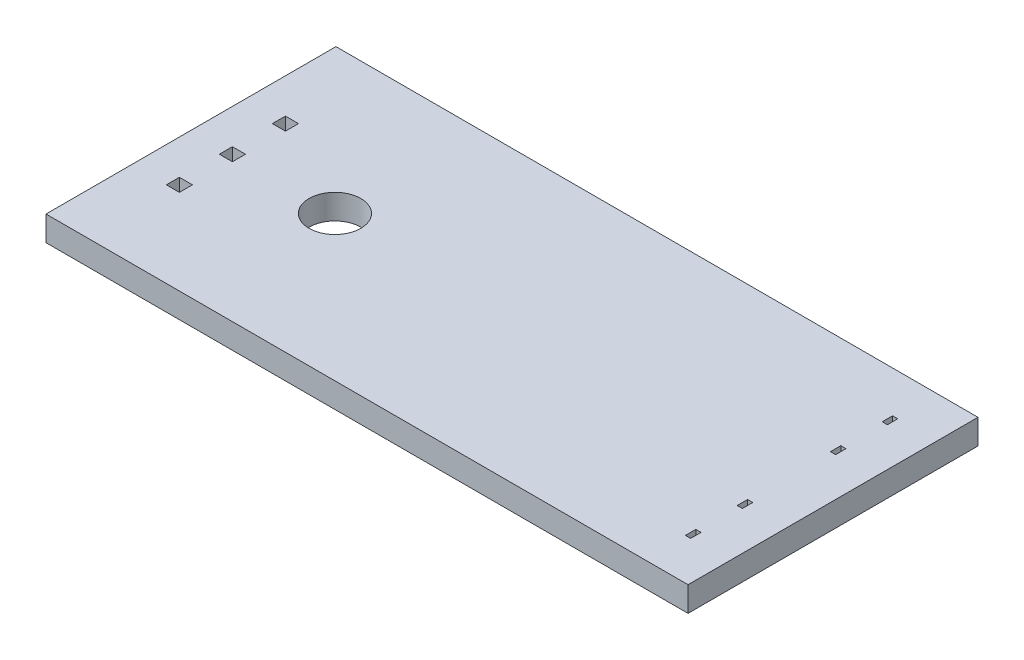
ISO-10303-21;
HEADER;
FILE_DESCRIPTION(('STEP AP214'),'2;1');
FILE_NAME('part.step','',(''),(''),'','','');
FILE_SCHEMA(('AUTOMOTIVE_DESIGN { 1 0 10303 214 1 1 1 1 }'));
ENDSEC;
DATA;
#1=APPLICATION_CONTEXT('core data for automotive mechanical design processes');
#2=APPLICATION_PROTOCOL_DEFINITION('international standard','automotive_design',2000,#1);
#3=PRODUCT_CONTEXT('',#1,'mechanical');
#4=PRODUCT('Part','Part','',(#3));
#5=PRODUCT_RELATED_PRODUCT_CATEGORY('part','',(#4));
#6=PRODUCT_DEFINITION_FORMATION('','',#4);
#7=PRODUCT_DEFINITION_CONTEXT('part definition',#1,'design');
#8=PRODUCT_DEFINITION('design','',#6,#7);
#9=PRODUCT_DEFINITION_SHAPE('','',#8);
#10=(LENGTH_UNIT() NAMED_UNIT(*) SI_UNIT(.MILLI.,.METRE.));
#11=(NAMED_UNIT(*) PLANE_ANGLE_UNIT() SI_UNIT($,.RADIAN.));
#12=(NAMED_UNIT(*) SI_UNIT($,.STERADIAN.) SOLID_ANGLE_UNIT());
#13=UNCERTAINTY_MEASURE_WITH_UNIT(LENGTH_MEASURE(1.E-05),#10,'distance_accuracy_value','');
#14=(GEOMETRIC_REPRESENTATION_CONTEXT(3) GLOBAL_UNCERTAINTY_ASSIGNED_CONTEXT((#13)) GLOBAL_UNIT_ASSIGNED_CONTEXT((#10,
#11,#12)) REPRESENTATION_CONTEXT('',''));
#15=CARTESIAN_POINT('',(0.,0.,0.));
#16=DIRECTION('',(0.,0.,1.));
#17=DIRECTION('',(1.,0.,0.));
#18=AXIS2_PLACEMENT_3D('',#15,#16,#17);
#19=CARTESIAN_POINT('',(15.25,1.2,6.64453125));
#20=DIRECTION('',(-1.,0.,0.));
#21=DIRECTION('',(0.,0.,1.));
#22=AXIS2_PLACEMENT_3D('',#19,#20,#21);
#23=PLANE('',#22);
#24=DIRECTION('',(0.,0.,-1.));
#25=VECTOR('',#24,1.);
#26=CARTESIAN_POINT('',(15.25,0.,6.64453125));
#27=LINE('',#26,#25);
#28=CARTESIAN_POINT('',(15.25,0.,6.64453125));
#29=VERTEX_POINT('',#28);
#30=CARTESIAN_POINT('',(15.25,0.,-7.35546875));
#31=VERTEX_POINT('',#30);
#32=EDGE_CURVE('E471',#29,#31,#27,.T.);
#33=ORIENTED_EDGE('',*,*,#32,.T.);
#34=DIRECTION('',(0.,-1.,0.));
#35=VECTOR('',#34,1.);
#36=CARTESIAN_POINT('',(15.25,1.2,-7.35546875));
#37=LINE('',#36,#35);
#38=CARTESIAN_POINT('',(15.25,1.2,-7.35546875));
#39=VERTEX_POINT('',#38);
#40=EDGE_CURVE('E11',#39,#31,#37,.T.);
#41=ORIENTED_EDGE('',*,*,#40,.F.);
#42=DIRECTION('',(0.,0.,-1.));
#43=VECTOR('',#42,1.);
#44=CARTESIAN_POINT('',(15.25,1.2,6.64453125));
#45=LINE('',#44,#43);
#46=CARTESIAN_POINT('',(15.25,1.2,6.64453125));
#47=VERTEX_POINT('',#46);
#48=EDGE_CURVE('E478',#47,#39,#45,.T.);
#49=ORIENTED_EDGE('',*,*,#48,.F.);
#50=DIRECTION('',(0.,-1.,0.));
#51=VECTOR('',#50,1.);
#52=CARTESIAN_POINT('',(15.25,1.2,6.64453125));
#53=LINE('',#52,#51);
#54=EDGE_CURVE('E488',#47,#29,#53,.T.);
#55=ORIENTED_EDGE('',*,*,#54,.T.);
#56=EDGE_LOOP('',(#33,#41,#49,#55));
#57=FACE_BOUND('',#56,.T.);
#58=ADVANCED_FACE('F35',(#57),#23,.F.);
#59=CARTESIAN_POINT('',(-15.75,1.2,-7.35546875));
#60=DIRECTION('',(0.,0.,1.));
#61=DIRECTION('',(1.,0.,0.));
#62=AXIS2_PLACEMENT_3D('',#59,#60,#61);
#63=PLANE('',#62);
#64=DIRECTION('',(-1.,0.,0.));
#65=VECTOR('',#64,1.);
#66=CARTESIAN_POINT('',(-15.75,0.,-7.35546875));
#67=LINE('',#66,#65);
#68=CARTESIAN_POINT('',(-15.75,0.,-7.35546875));
#69=VERTEX_POINT('',#68);
#70=EDGE_CURVE('E491',#31,#69,#67,.T.);
#71=ORIENTED_EDGE('',*,*,#70,.T.);
#72=DIRECTION('',(0.,-1.,0.));
#73=VECTOR('',#72,1.);
#74=CARTESIAN_POINT('',(-15.75,1.2,-7.35546875));
#75=LINE('',#74,#73);
#76=CARTESIAN_POINT('',(-15.75,1.2,-7.35546875));
#77=VERTEX_POINT('',#76);
#78=EDGE_CURVE('E42',#77,#69,#75,.T.);
#79=ORIENTED_EDGE('',*,*,#78,.F.);
#80=DIRECTION('',(-1.,0.,0.));
#81=VECTOR('',#80,1.);
#82=CARTESIAN_POINT('',(-15.75,1.2,-7.35546875));
#83=LINE('',#82,#81);
#84=EDGE_CURVE('E481',#39,#77,#83,.T.);
#85=ORIENTED_EDGE('',*,*,#84,.F.);
#86=ORIENTED_EDGE('',*,*,#40,.T.);
#87=EDGE_LOOP('',(#71,#79,#85,#86));
#88=FACE_BOUND('',#87,.T.);
#89=ADVANCED_FACE('F520',(#88),#63,.F.);
#90=CARTESIAN_POINT('',(-15.75,1.2,6.64453125));
#91=DIRECTION('',(1.,0.,0.));
#92=DIRECTION('',(0.,0.,-1.));
#93=AXIS2_PLACEMENT_3D('',#90,#91,#92);
#94=PLANE('',#93);
#95=DIRECTION('',(0.,0.,1.));
#96=VECTOR('',#95,1.);
#97=CARTESIAN_POINT('',(-15.75,0.,6.64453125));
#98=LINE('',#97,#96);
#99=CARTESIAN_POINT('',(-15.75,0.,6.64453125));
#100=VERTEX_POINT('',#99);
#101=EDGE_CURVE('E493',#69,#100,#98,.T.);
#102=ORIENTED_EDGE('',*,*,#101,.T.);
#103=DIRECTION('',(0.,-1.,0.));
#104=VECTOR('',#103,1.);
#105=CARTESIAN_POINT('',(-15.75,1.2,6.64453125));
#106=LINE('',#105,#104);
#107=CARTESIAN_POINT('',(-15.75,1.2,6.64453125));
#108=VERTEX_POINT('',#107);
#109=EDGE_CURVE('E498',#108,#100,#106,.T.);
#110=ORIENTED_EDGE('',*,*,#109,.F.);
#111=DIRECTION('',(0.,0.,1.));
#112=VECTOR('',#111,1.);
#113=CARTESIAN_POINT('',(-15.75,1.2,6.64453125));
#114=LINE('',#113,#112);
#115=EDGE_CURVE('E484',#77,#108,#114,.T.);
#116=ORIENTED_EDGE('',*,*,#115,.F.);
#117=ORIENTED_EDGE('',*,*,#78,.T.);
#118=EDGE_LOOP('',(#102,#110,#116,#117));
#119=FACE_BOUND('',#118,.T.);
#120=ADVANCED_FACE('F505',(#119),#94,.F.);
#121=CARTESIAN_POINT('',(-15.75,1.2,6.64453125));
#122=DIRECTION('',(0.,0.,-1.));
#123=DIRECTION('',(-1.,0.,0.));
#124=AXIS2_PLACEMENT_3D('',#121,#122,#123);
#125=PLANE('',#124);
#126=DIRECTION('',(1.,0.,0.));
#127=VECTOR('',#126,1.);
#128=CARTESIAN_POINT('',(-15.75,0.,6.64453125));
#129=LINE('',#128,#127);
#130=EDGE_CURVE('E482',#100,#29,#129,.T.);
#131=ORIENTED_EDGE('',*,*,#130,.T.);
#132=ORIENTED_EDGE('',*,*,#54,.F.);
#133=DIRECTION('',(1.,0.,0.));
#134=VECTOR('',#133,1.);
#135=CARTESIAN_POINT('',(-15.75,1.2,6.64453125));
#136=LINE('',#135,#134);
#137=EDGE_CURVE('E486',#108,#47,#136,.T.);
#138=ORIENTED_EDGE('',*,*,#137,.F.);
#139=ORIENTED_EDGE('',*,*,#109,.T.);
#140=EDGE_LOOP('',(#131,#132,#138,#139));
#141=FACE_BOUND('',#140,.T.);
#142=ADVANCED_FACE('F513',(#141),#125,.F.);
#143=CARTESIAN_POINT('',(0.,1.2,0.));
#144=DIRECTION('',(0.,-1.,0.));
#145=DIRECTION('',(0.,0.,-1.));
#146=AXIS2_PLACEMENT_3D('',#143,#144,#145);
#147=PLANE('',#146);
#148=DIRECTION('',(1.,0.,0.));
#149=VECTOR('',#148,1.);
#150=CARTESIAN_POINT('',(13.125,1.2,-4.85546875));
#151=LINE('',#150,#149);
#152=CARTESIAN_POINT('',(13.125,1.2,-4.85546875));
#153=VERTEX_POINT('',#152);
#154=CARTESIAN_POINT('',(13.375,1.2,-4.85546875));
#155=VERTEX_POINT('',#154);
#156=EDGE_CURVE('E270',#153,#155,#151,.T.);
#157=ORIENTED_EDGE('',*,*,#156,.F.);
#158=DIRECTION('',(0.,0.,1.));
#159=VECTOR('',#158,1.);
#160=CARTESIAN_POINT('',(13.125,1.2,-5.35546875));
#161=LINE('',#160,#159);
#162=CARTESIAN_POINT('',(13.125,1.2,-5.35546875));
#163=VERTEX_POINT('',#162);
#164=EDGE_CURVE('E49',#163,#153,#161,.T.);
#165=ORIENTED_EDGE('',*,*,#164,.F.);
#166=DIRECTION('',(-1.,0.,0.));
#167=VECTOR('',#166,1.);
#168=CARTESIAN_POINT('',(13.125,1.2,-5.35546875));
#169=LINE('',#168,#167);
#170=CARTESIAN_POINT('',(13.375,1.2,-5.35546875));
#171=VERTEX_POINT('',#170);
#172=EDGE_CURVE('E261',#171,#163,#169,.T.);
#173=ORIENTED_EDGE('',*,*,#172,.F.);
#174=DIRECTION('',(0.,0.,-1.));
#175=VECTOR('',#174,1.);
#176=CARTESIAN_POINT('',(13.375,1.2,-5.35546875));
#177=LINE('',#176,#175);
#178=EDGE_CURVE('E264',#155,#171,#177,.T.);
#179=ORIENTED_EDGE('',*,*,#178,.F.);
#180=EDGE_LOOP('',(#157,#165,#173,#179));
#181=FACE_BOUND('',#180,.T.);
#182=DIRECTION('',(-1.,0.,0.));
#183=VECTOR('',#182,1.);
#184=CARTESIAN_POINT('',(13.375,1.2,-2.85546875));
#185=LINE('',#184,#183);
#186=CARTESIAN_POINT('',(13.375,1.2,-2.85546875));
#187=VERTEX_POINT('',#186);
#188=CARTESIAN_POINT('',(13.125,1.2,-2.85546875));
#189=VERTEX_POINT('',#188);
#190=EDGE_CURVE('E295',#187,#189,#185,.T.);
#191=ORIENTED_EDGE('',*,*,#190,.F.);
#192=DIRECTION('',(0.,0.,-1.));
#193=VECTOR('',#192,1.);
#194=CARTESIAN_POINT('',(13.375,1.2,-2.85546875));
#195=LINE('',#194,#193);
#196=CARTESIAN_POINT('',(13.375,1.2,-2.35546875));
#197=VERTEX_POINT('',#196);
#198=EDGE_CURVE('E276',#197,#187,#195,.T.);
#199=ORIENTED_EDGE('',*,*,#198,.F.);
#200=DIRECTION('',(1.,0.,0.));
#201=VECTOR('',#200,1.);
#202=CARTESIAN_POINT('',(13.375,1.2,-2.35546875));
#203=LINE('',#202,#201);
#204=CARTESIAN_POINT('',(13.125,1.2,-2.35546875));
#205=VERTEX_POINT('',#204);
#206=EDGE_CURVE('E284',#205,#197,#203,.T.);
#207=ORIENTED_EDGE('',*,*,#206,.F.);
#208=DIRECTION('',(0.,0.,1.));
#209=VECTOR('',#208,1.);
#210=CARTESIAN_POINT('',(13.125,1.2,-2.85546875));
#211=LINE('',#210,#209);
#212=EDGE_CURVE('E298',#189,#205,#211,.T.);
#213=ORIENTED_EDGE('',*,*,#212,.F.);
#214=EDGE_LOOP('',(#191,#199,#207,#213));
#215=FACE_BOUND('',#214,.T.);
#216=DIRECTION('',(0.,0.,1.));
#217=VECTOR('',#216,1.);
#218=CARTESIAN_POINT('',(-14.065,1.2,-3.23046875000001));
#219=LINE('',#218,#217);
#220=CARTESIAN_POINT('',(-14.065,1.2,-3.23046875000001));
#221=VERTEX_POINT('',#220);
#222=CARTESIAN_POINT('',(-14.065,1.2,-2.60046875000001));
#223=VERTEX_POINT('',#222);
#224=EDGE_CURVE('E327',#221,#223,#219,.T.);
#225=ORIENTED_EDGE('',*,*,#224,.F.);
#226=DIRECTION('',(-1.,0.,0.));
#227=VECTOR('',#226,1.);
#228=CARTESIAN_POINT('',(-13.435,1.2,-3.23046875000001));
#229=LINE('',#228,#227);
#230=CARTESIAN_POINT('',(-13.435,1.2,-3.23046875000001));
#231=VERTEX_POINT('',#230);
#232=EDGE_CURVE('E305',#231,#221,#229,.T.);
#233=ORIENTED_EDGE('',*,*,#232,.F.);
#234=DIRECTION('',(0.,0.,-1.));
#235=VECTOR('',#234,1.);
#236=CARTESIAN_POINT('',(-13.435,1.2,-3.23046875000001));
#237=LINE('',#236,#235);
#238=CARTESIAN_POINT('',(-13.435,1.2,-2.60046875000001));
#239=VERTEX_POINT('',#238);
#240=EDGE_CURVE('E316',#239,#231,#237,.T.);
#241=ORIENTED_EDGE('',*,*,#240,.F.);
#242=DIRECTION('',(1.,0.,0.));
#243=VECTOR('',#242,1.);
#244=CARTESIAN_POINT('',(-13.435,1.2,-2.60046875000001));
#245=LINE('',#244,#243);
#246=EDGE_CURVE('E330',#223,#239,#245,.T.);
#247=ORIENTED_EDGE('',*,*,#246,.F.);
#248=EDGE_LOOP('',(#225,#233,#241,#247));
#249=FACE_BOUND('',#248,.T.);
#250=DIRECTION('',(1.,0.,0.));
#251=VECTOR('',#250,1.);
#252=CARTESIAN_POINT('',(-13.435,1.2,2.51953125));
#253=LINE('',#252,#251);
#254=CARTESIAN_POINT('',(-14.065,1.2,2.51953125));
#255=VERTEX_POINT('',#254);
#256=CARTESIAN_POINT('',(-13.435,1.2,2.51953125));
#257=VERTEX_POINT('',#256);
#258=EDGE_CURVE('E359',#255,#257,#253,.T.);
#259=ORIENTED_EDGE('',*,*,#258,.F.);
#260=DIRECTION('',(0.,0.,1.));
#261=VECTOR('',#260,1.);
#262=CARTESIAN_POINT('',(-14.065,1.2,2.51953125));
#263=LINE('',#262,#261);
#264=CARTESIAN_POINT('',(-14.065,1.2,1.88953125));
#265=VERTEX_POINT('',#264);
#266=EDGE_CURVE('E337',#265,#255,#263,.T.);
#267=ORIENTED_EDGE('',*,*,#266,.F.);
#268=DIRECTION('',(-1.,0.,0.));
#269=VECTOR('',#268,1.);
#270=CARTESIAN_POINT('',(-13.435,1.2,1.88953125));
#271=LINE('',#270,#269);
#272=CARTESIAN_POINT('',(-13.435,1.2,1.88953125));
#273=VERTEX_POINT('',#272);
#274=EDGE_CURVE('E348',#273,#265,#271,.T.);
#275=ORIENTED_EDGE('',*,*,#274,.F.);
#276=DIRECTION('',(0.,0.,-1.));
#277=VECTOR('',#276,1.);
#278=CARTESIAN_POINT('',(-13.435,1.2,2.51953125));
#279=LINE('',#278,#277);
#280=EDGE_CURVE('E362',#257,#273,#279,.T.);
#281=ORIENTED_EDGE('',*,*,#280,.F.);
#282=EDGE_LOOP('',(#259,#267,#275,#281));
#283=FACE_BOUND('',#282,.T.);
#284=CARTESIAN_POINT('',(-8.8,1.2,-0.355468749999997));
#285=DIRECTION('',(0.,1.,0.));
#286=DIRECTION('',(0.,0.,1.));
#287=AXIS2_PLACEMENT_3D('',#284,#285,#286);
#288=CIRCLE('',#287,1.25);
#289=CARTESIAN_POINT('',(-8.8,1.2,0.894531250000003));
#290=VERTEX_POINT('',#289);
#291=EDGE_CURVE('E369',#290,#290,#288,.T.);
#292=ORIENTED_EDGE('',*,*,#291,.F.);
#293=EDGE_LOOP('',(#292));
#294=FACE_BOUND('',#293,.T.);
#295=DIRECTION('',(1.,0.,0.));
#296=VECTOR('',#295,1.);
#297=CARTESIAN_POINT('',(-13.435,1.2,-0.0404687499999966));
#298=LINE('',#297,#296);
#299=CARTESIAN_POINT('',(-14.065,1.2,-0.0404687499999966));
#300=VERTEX_POINT('',#299);
#301=CARTESIAN_POINT('',(-13.435,1.2,-0.0404687499999966));
#302=VERTEX_POINT('',#301);
#303=EDGE_CURVE('E397',#300,#302,#298,.T.);
#304=ORIENTED_EDGE('',*,*,#303,.F.);
#305=DIRECTION('',(0.,0.,1.));
#306=VECTOR('',#305,1.);
#307=CARTESIAN_POINT('',(-14.065,1.2,-0.0404687499999966));
#308=LINE('',#307,#306);
#309=CARTESIAN_POINT('',(-14.065,1.2,-0.670468749999997));
#310=VERTEX_POINT('',#309);
#311=EDGE_CURVE('E379',#310,#300,#308,.T.);
#312=ORIENTED_EDGE('',*,*,#311,.F.);
#313=DIRECTION('',(-1.,0.,0.));
#314=VECTOR('',#313,1.);
#315=CARTESIAN_POINT('',(-13.435,1.2,-0.670468749999997));
#316=LINE('',#315,#314);
#317=CARTESIAN_POINT('',(-13.435,1.2,-0.670468749999997));
#318=VERTEX_POINT('',#317);
#319=EDGE_CURVE('E386',#318,#310,#316,.T.);
#320=ORIENTED_EDGE('',*,*,#319,.F.);
#321=DIRECTION('',(0.,0.,-1.));
#322=VECTOR('',#321,1.);
#323=CARTESIAN_POINT('',(-13.435,1.2,-0.0404687499999966));
#324=LINE('',#323,#322);
#325=EDGE_CURVE('E400',#302,#318,#324,.T.);
#326=ORIENTED_EDGE('',*,*,#325,.F.);
#327=EDGE_LOOP('',(#304,#312,#320,#326));
#328=FACE_BOUND('',#327,.T.);
#329=DIRECTION('',(1.,0.,0.));
#330=VECTOR('',#329,1.);
#331=CARTESIAN_POINT('',(13.375,1.2,2.14453125));
#332=LINE('',#331,#330);
#333=CARTESIAN_POINT('',(13.125,1.2,2.14453125));
#334=VERTEX_POINT('',#333);
#335=CARTESIAN_POINT('',(13.375,1.2,2.14453125));
#336=VERTEX_POINT('',#335);
#337=EDGE_CURVE('E429',#334,#336,#332,.T.);
#338=ORIENTED_EDGE('',*,*,#337,.F.);
#339=DIRECTION('',(0.,0.,1.));
#340=VECTOR('',#339,1.);
#341=CARTESIAN_POINT('',(13.125,1.2,2.14453125));
#342=LINE('',#341,#340);
#343=CARTESIAN_POINT('',(13.125,1.2,1.64453125));
#344=VERTEX_POINT('',#343);
#345=EDGE_CURVE('E407',#344,#334,#342,.T.);
#346=ORIENTED_EDGE('',*,*,#345,.F.);
#347=DIRECTION('',(-1.,0.,0.));
#348=VECTOR('',#347,1.);
#349=CARTESIAN_POINT('',(13.375,1.2,1.64453125));
#350=LINE('',#349,#348);
#351=CARTESIAN_POINT('',(13.375,1.2,1.64453125));
#352=VERTEX_POINT('',#351);
#353=EDGE_CURVE('E418',#352,#344,#350,.T.);
#354=ORIENTED_EDGE('',*,*,#353,.F.);
#355=DIRECTION('',(0.,0.,-1.));
#356=VECTOR('',#355,1.);
#357=CARTESIAN_POINT('',(13.375,1.2,2.14453125));
#358=LINE('',#357,#356);
#359=EDGE_CURVE('E432',#336,#352,#358,.T.);
#360=ORIENTED_EDGE('',*,*,#359,.F.);
#361=EDGE_LOOP('',(#338,#346,#354,#360));
#362=FACE_BOUND('',#361,.T.);
#363=DIRECTION('',(-1.,0.,0.));
#364=VECTOR('',#363,1.);
#365=CARTESIAN_POINT('',(13.125,1.2,4.14453125));
#366=LINE('',#365,#364);
#367=CARTESIAN_POINT('',(13.375,1.2,4.14453125));
#368=VERTEX_POINT('',#367);
#369=CARTESIAN_POINT('',(13.125,1.2,4.14453125));
#370=VERTEX_POINT('',#369);
#371=EDGE_CURVE('E461',#368,#370,#366,.T.);
#372=ORIENTED_EDGE('',*,*,#371,.F.);
#373=DIRECTION('',(0.,0.,-1.));
#374=VECTOR('',#373,1.);
#375=CARTESIAN_POINT('',(13.375,1.2,4.64453125));
#376=LINE('',#375,#374);
#377=CARTESIAN_POINT('',(13.375,1.2,4.64453125));
#378=VERTEX_POINT('',#377);
#379=EDGE_CURVE('E439',#378,#368,#376,.T.);
#380=ORIENTED_EDGE('',*,*,#379,.F.);
#381=DIRECTION('',(1.,0.,0.));
#382=VECTOR('',#381,1.);
#383=CARTESIAN_POINT('',(13.125,1.2,4.64453125));
#384=LINE('',#383,#382);
#385=CARTESIAN_POINT('',(13.125,1.2,4.64453125));
#386=VERTEX_POINT('',#385);
#387=EDGE_CURVE('E450',#386,#378,#384,.T.);
#388=ORIENTED_EDGE('',*,*,#387,.F.);
#389=DIRECTION('',(0.,0.,1.));
#390=VECTOR('',#389,1.);
#391=CARTESIAN_POINT('',(13.125,1.2,4.64453125));
#392=LINE('',#391,#390);
#393=EDGE_CURVE('E464',#370,#386,#392,.T.);
#394=ORIENTED_EDGE('',*,*,#393,.F.);
#395=EDGE_LOOP('',(#372,#380,#388,#394));
#396=FACE_BOUND('',#395,.T.);
#397=ORIENTED_EDGE('',*,*,#48,.T.);
#398=ORIENTED_EDGE('',*,*,#84,.T.);
#399=ORIENTED_EDGE('',*,*,#115,.T.);
#400=ORIENTED_EDGE('',*,*,#137,.T.);
#401=EDGE_LOOP('',(#397,#398,#399,#400));
#402=FACE_BOUND('',#401,.T.);
#403=ADVANCED_FACE('F519',(#181,#215,#249,#283,#294,#328,#362,#396,#402),#147,.F.);
#404=CARTESIAN_POINT('',(0.,0.,0.));
#405=DIRECTION('',(0.,-1.,0.));
#406=DIRECTION('',(0.,0.,-1.));
#407=AXIS2_PLACEMENT_3D('',#404,#405,#406);
#408=PLANE('',#407);
#409=DIRECTION('',(0.,0.,1.));
#410=VECTOR('',#409,1.);
#411=CARTESIAN_POINT('',(13.125,0.,-5.35546875));
#412=LINE('',#411,#410);
#413=CARTESIAN_POINT('',(13.125,0.,-5.35546875));
#414=VERTEX_POINT('',#413);
#415=CARTESIAN_POINT('',(13.125,0.,-4.85546875));
#416=VERTEX_POINT('',#415);
#417=EDGE_CURVE('E245',#414,#416,#412,.T.);
#418=ORIENTED_EDGE('',*,*,#417,.T.);
#419=DIRECTION('',(1.,0.,0.));
#420=VECTOR('',#419,1.);
#421=CARTESIAN_POINT('',(13.125,0.,-4.85546875));
#422=LINE('',#421,#420);
#423=CARTESIAN_POINT('',(13.375,0.,-4.85546875));
#424=VERTEX_POINT('',#423);
#425=EDGE_CURVE('E254',#416,#424,#422,.T.);
#426=ORIENTED_EDGE('',*,*,#425,.T.);
#427=DIRECTION('',(0.,0.,-1.));
#428=VECTOR('',#427,1.);
#429=CARTESIAN_POINT('',(13.375,0.,-5.35546875));
#430=LINE('',#429,#428);
#431=CARTESIAN_POINT('',(13.375,0.,-5.35546875));
#432=VERTEX_POINT('',#431);
#433=EDGE_CURVE('E57',#424,#432,#430,.T.);
#434=ORIENTED_EDGE('',*,*,#433,.T.);
#435=DIRECTION('',(-1.,0.,0.));
#436=VECTOR('',#435,1.);
#437=CARTESIAN_POINT('',(13.125,0.,-5.35546875));
#438=LINE('',#437,#436);
#439=EDGE_CURVE('E251',#432,#414,#438,.T.);
#440=ORIENTED_EDGE('',*,*,#439,.T.);
#441=EDGE_LOOP('',(#418,#426,#434,#440));
#442=FACE_BOUND('',#441,.T.);
#443=DIRECTION('',(0.,0.,-1.));
#444=VECTOR('',#443,1.);
#445=CARTESIAN_POINT('',(13.375,0.,-2.85546875));
#446=LINE('',#445,#444);
#447=CARTESIAN_POINT('',(13.375,0.,-2.35546875));
#448=VERTEX_POINT('',#447);
#449=CARTESIAN_POINT('',(13.375,0.,-2.85546875));
#450=VERTEX_POINT('',#449);
#451=EDGE_CURVE('E280',#448,#450,#446,.T.);
#452=ORIENTED_EDGE('',*,*,#451,.T.);
#453=DIRECTION('',(-1.,0.,0.));
#454=VECTOR('',#453,1.);
#455=CARTESIAN_POINT('',(13.375,0.,-2.85546875));
#456=LINE('',#455,#454);
#457=CARTESIAN_POINT('',(13.125,0.,-2.85546875));
#458=VERTEX_POINT('',#457);
#459=EDGE_CURVE('E283',#450,#458,#456,.T.);
#460=ORIENTED_EDGE('',*,*,#459,.T.);
#461=DIRECTION('',(0.,0.,1.));
#462=VECTOR('',#461,1.);
#463=CARTESIAN_POINT('',(13.125,0.,-2.85546875));
#464=LINE('',#463,#462);
#465=CARTESIAN_POINT('',(13.125,0.,-2.35546875));
#466=VERTEX_POINT('',#465);
#467=EDGE_CURVE('E287',#458,#466,#464,.T.);
#468=ORIENTED_EDGE('',*,*,#467,.T.);
#469=DIRECTION('',(1.,0.,0.));
#470=VECTOR('',#469,1.);
#471=CARTESIAN_POINT('',(13.375,0.,-2.35546875));
#472=LINE('',#471,#470);
#473=EDGE_CURVE('E290',#466,#448,#472,.T.);
#474=ORIENTED_EDGE('',*,*,#473,.T.);
#475=EDGE_LOOP('',(#452,#460,#468,#474));
#476=FACE_BOUND('',#475,.T.);
#477=DIRECTION('',(-1.,0.,0.));
#478=VECTOR('',#477,1.);
#479=CARTESIAN_POINT('',(-13.435,0.,-3.23046875000001));
#480=LINE('',#479,#478);
#481=CARTESIAN_POINT('',(-13.435,0.,-3.23046875000001));
#482=VERTEX_POINT('',#481);
#483=CARTESIAN_POINT('',(-14.065,0.,-3.23046875000001));
#484=VERTEX_POINT('',#483);
#485=EDGE_CURVE('E312',#482,#484,#480,.T.);
#486=ORIENTED_EDGE('',*,*,#485,.T.);
#487=DIRECTION('',(0.,0.,1.));
#488=VECTOR('',#487,1.);
#489=CARTESIAN_POINT('',(-14.065,0.,-3.23046875000001));
#490=LINE('',#489,#488);
#491=CARTESIAN_POINT('',(-14.065,0.,-2.60046875000001));
#492=VERTEX_POINT('',#491);
#493=EDGE_CURVE('E315',#484,#492,#490,.T.);
#494=ORIENTED_EDGE('',*,*,#493,.T.);
#495=DIRECTION('',(1.,0.,0.));
#496=VECTOR('',#495,1.);
#497=CARTESIAN_POINT('',(-13.435,0.,-2.60046875000001));
#498=LINE('',#497,#496);
#499=CARTESIAN_POINT('',(-13.435,0.,-2.60046875000001));
#500=VERTEX_POINT('',#499);
#501=EDGE_CURVE('E319',#492,#500,#498,.T.);
#502=ORIENTED_EDGE('',*,*,#501,.T.);
#503=DIRECTION('',(0.,0.,-1.));
#504=VECTOR('',#503,1.);
#505=CARTESIAN_POINT('',(-13.435,0.,-3.23046875000001));
#506=LINE('',#505,#504);
#507=EDGE_CURVE('E322',#500,#482,#506,.T.);
#508=ORIENTED_EDGE('',*,*,#507,.T.);
#509=EDGE_LOOP('',(#486,#494,#502,#508));
#510=FACE_BOUND('',#509,.T.);
#511=DIRECTION('',(0.,0.,1.));
#512=VECTOR('',#511,1.);
#513=CARTESIAN_POINT('',(-14.065,0.,2.51953125));
#514=LINE('',#513,#512);
#515=CARTESIAN_POINT('',(-14.065,0.,1.88953125));
#516=VERTEX_POINT('',#515);
#517=CARTESIAN_POINT('',(-14.065,0.,2.51953125));
#518=VERTEX_POINT('',#517);
#519=EDGE_CURVE('E344',#516,#518,#514,.T.);
#520=ORIENTED_EDGE('',*,*,#519,.T.);
#521=DIRECTION('',(1.,0.,0.));
#522=VECTOR('',#521,1.);
#523=CARTESIAN_POINT('',(-13.435,0.,2.51953125));
#524=LINE('',#523,#522);
#525=CARTESIAN_POINT('',(-13.435,0.,2.51953125));
#526=VERTEX_POINT('',#525);
#527=EDGE_CURVE('E347',#518,#526,#524,.T.);
#528=ORIENTED_EDGE('',*,*,#527,.T.);
#529=DIRECTION('',(0.,0.,-1.));
#530=VECTOR('',#529,1.);
#531=CARTESIAN_POINT('',(-13.435,0.,2.51953125));
#532=LINE('',#531,#530);
#533=CARTESIAN_POINT('',(-13.435,0.,1.88953125));
#534=VERTEX_POINT('',#533);
#535=EDGE_CURVE('E351',#526,#534,#532,.T.);
#536=ORIENTED_EDGE('',*,*,#535,.T.);
#537=DIRECTION('',(-1.,0.,0.));
#538=VECTOR('',#537,1.);
#539=CARTESIAN_POINT('',(-13.435,0.,1.88953125));
#540=LINE('',#539,#538);
#541=EDGE_CURVE('E354',#534,#516,#540,.T.);
#542=ORIENTED_EDGE('',*,*,#541,.T.);
#543=EDGE_LOOP('',(#520,#528,#536,#542));
#544=FACE_BOUND('',#543,.T.);
#545=CARTESIAN_POINT('',(-8.8,0.,-0.355468749999997));
#546=DIRECTION('',(0.,1.,0.));
#547=DIRECTION('',(0.,0.,1.));
#548=AXIS2_PLACEMENT_3D('',#545,#546,#547);
#549=CIRCLE('',#548,1.25);
#550=CARTESIAN_POINT('',(-8.8,0.,0.894531250000003));
#551=VERTEX_POINT('',#550);
#552=EDGE_CURVE('E376',#551,#551,#549,.T.);
#553=ORIENTED_EDGE('',*,*,#552,.T.);
#554=EDGE_LOOP('',(#553));
#555=FACE_BOUND('',#554,.T.);
#556=DIRECTION('',(0.,0.,1.));
#557=VECTOR('',#556,1.);
#558=CARTESIAN_POINT('',(-14.065,0.,-0.0404687499999966));
#559=LINE('',#558,#557);
#560=CARTESIAN_POINT('',(-14.065,0.,-0.670468749999997));
#561=VERTEX_POINT('',#560);
#562=CARTESIAN_POINT('',(-14.065,0.,-0.0404687499999966));
#563=VERTEX_POINT('',#562);
#564=EDGE_CURVE('E382',#561,#563,#559,.T.);
#565=ORIENTED_EDGE('',*,*,#564,.T.);
#566=DIRECTION('',(1.,0.,0.));
#567=VECTOR('',#566,1.);
#568=CARTESIAN_POINT('',(-13.435,0.,-0.0404687499999966));
#569=LINE('',#568,#567);
#570=CARTESIAN_POINT('',(-13.435,0.,-0.0404687499999966));
#571=VERTEX_POINT('',#570);
#572=EDGE_CURVE('E385',#563,#571,#569,.T.);
#573=ORIENTED_EDGE('',*,*,#572,.T.);
#574=DIRECTION('',(0.,0.,-1.));
#575=VECTOR('',#574,1.);
#576=CARTESIAN_POINT('',(-13.435,0.,-0.0404687499999966));
#577=LINE('',#576,#575);
#578=CARTESIAN_POINT('',(-13.435,0.,-0.670468749999997));
#579=VERTEX_POINT('',#578);
#580=EDGE_CURVE('E389',#571,#579,#577,.T.);
#581=ORIENTED_EDGE('',*,*,#580,.T.);
#582=DIRECTION('',(-1.,0.,0.));
#583=VECTOR('',#582,1.);
#584=CARTESIAN_POINT('',(-13.435,0.,-0.670468749999997));
#585=LINE('',#584,#583);
#586=EDGE_CURVE('E392',#579,#561,#585,.T.);
#587=ORIENTED_EDGE('',*,*,#586,.T.);
#588=EDGE_LOOP('',(#565,#573,#581,#587));
#589=FACE_BOUND('',#588,.T.);
#590=DIRECTION('',(0.,0.,1.));
#591=VECTOR('',#590,1.);
#592=CARTESIAN_POINT('',(13.125,0.,2.14453125));
#593=LINE('',#592,#591);
#594=CARTESIAN_POINT('',(13.125,0.,1.64453125));
#595=VERTEX_POINT('',#594);
#596=CARTESIAN_POINT('',(13.125,0.,2.14453125));
#597=VERTEX_POINT('',#596);
#598=EDGE_CURVE('E414',#595,#597,#593,.T.);
#599=ORIENTED_EDGE('',*,*,#598,.T.);
#600=DIRECTION('',(1.,0.,0.));
#601=VECTOR('',#600,1.);
#602=CARTESIAN_POINT('',(13.375,0.,2.14453125));
#603=LINE('',#602,#601);
#604=CARTESIAN_POINT('',(13.375,0.,2.14453125));
#605=VERTEX_POINT('',#604);
#606=EDGE_CURVE('E417',#597,#605,#603,.T.);
#607=ORIENTED_EDGE('',*,*,#606,.T.);
#608=DIRECTION('',(0.,0.,-1.));
#609=VECTOR('',#608,1.);
#610=CARTESIAN_POINT('',(13.375,0.,2.14453125));
#611=LINE('',#610,#609);
#612=CARTESIAN_POINT('',(13.375,0.,1.64453125));
#613=VERTEX_POINT('',#612);
#614=EDGE_CURVE('E421',#605,#613,#611,.T.);
#615=ORIENTED_EDGE('',*,*,#614,.T.);
#616=DIRECTION('',(-1.,0.,0.));
#617=VECTOR('',#616,1.);
#618=CARTESIAN_POINT('',(13.375,0.,1.64453125));
#619=LINE('',#618,#617);
#620=EDGE_CURVE('E424',#613,#595,#619,.T.);
#621=ORIENTED_EDGE('',*,*,#620,.T.);
#622=EDGE_LOOP('',(#599,#607,#615,#621));
#623=FACE_BOUND('',#622,.T.);
#624=DIRECTION('',(0.,0.,-1.));
#625=VECTOR('',#624,1.);
#626=CARTESIAN_POINT('',(13.375,0.,4.64453125));
#627=LINE('',#626,#625);
#628=CARTESIAN_POINT('',(13.375,0.,4.64453125));
#629=VERTEX_POINT('',#628);
#630=CARTESIAN_POINT('',(13.375,0.,4.14453125));
#631=VERTEX_POINT('',#630);
#632=EDGE_CURVE('E446',#629,#631,#627,.T.);
#633=ORIENTED_EDGE('',*,*,#632,.T.);
#634=DIRECTION('',(-1.,0.,0.));
#635=VECTOR('',#634,1.);
#636=CARTESIAN_POINT('',(13.125,0.,4.14453125));
#637=LINE('',#636,#635);
#638=CARTESIAN_POINT('',(13.125,0.,4.14453125));
#639=VERTEX_POINT('',#638);
#640=EDGE_CURVE('E449',#631,#639,#637,.T.);
#641=ORIENTED_EDGE('',*,*,#640,.T.);
#642=DIRECTION('',(0.,0.,1.));
#643=VECTOR('',#642,1.);
#644=CARTESIAN_POINT('',(13.125,0.,4.64453125));
#645=LINE('',#644,#643);
#646=CARTESIAN_POINT('',(13.125,0.,4.64453125));
#647=VERTEX_POINT('',#646);
#648=EDGE_CURVE('E453',#639,#647,#645,.T.);
#649=ORIENTED_EDGE('',*,*,#648,.T.);
#650=DIRECTION('',(1.,0.,0.));
#651=VECTOR('',#650,1.);
#652=CARTESIAN_POINT('',(13.125,0.,4.64453125));
#653=LINE('',#652,#651);
#654=EDGE_CURVE('E456',#647,#629,#653,.T.);
#655=ORIENTED_EDGE('',*,*,#654,.T.);
#656=EDGE_LOOP('',(#633,#641,#649,#655));
#657=FACE_BOUND('',#656,.T.);
#658=ORIENTED_EDGE('',*,*,#32,.F.);
#659=ORIENTED_EDGE('',*,*,#130,.F.);
#660=ORIENTED_EDGE('',*,*,#101,.F.);
#661=ORIENTED_EDGE('',*,*,#70,.F.);
#662=EDGE_LOOP('',(#658,#659,#660,#661));
#663=FACE_BOUND('',#662,.T.);
#664=ADVANCED_FACE('F258',(#442,#476,#510,#544,#555,#589,#623,#657,#663),#408,.T.);
#665=CARTESIAN_POINT('',(13.375,0.,4.64453125));
#666=DIRECTION('',(1.,0.,0.));
#667=DIRECTION('',(0.,0.,-1.));
#668=AXIS2_PLACEMENT_3D('',#665,#666,#667);
#669=PLANE('',#668);
#670=ORIENTED_EDGE('',*,*,#379,.T.);
#671=DIRECTION('',(0.,1.,0.));
#672=VECTOR('',#671,1.);
#673=CARTESIAN_POINT('',(13.375,0.,4.14453125));
#674=LINE('',#673,#672);
#675=EDGE_CURVE('E459',#631,#368,#674,.T.);
#676=ORIENTED_EDGE('',*,*,#675,.F.);
#677=ORIENTED_EDGE('',*,*,#632,.F.);
#678=DIRECTION('',(0.,1.,0.));
#679=VECTOR('',#678,1.);
#680=CARTESIAN_POINT('',(13.375,0.,4.64453125));
#681=LINE('',#680,#679);
#682=EDGE_CURVE('E469',#629,#378,#681,.T.);
#683=ORIENTED_EDGE('',*,*,#682,.T.);
#684=EDGE_LOOP('',(#670,#676,#677,#683));
#685=FACE_BOUND('',#684,.T.);
#686=ADVANCED_FACE('F532',(#685),#669,.F.);
#687=CARTESIAN_POINT('',(13.125,0.,4.64453125));
#688=DIRECTION('',(0.,0.,1.));
#689=DIRECTION('',(1.,0.,0.));
#690=AXIS2_PLACEMENT_3D('',#687,#688,#689);
#691=PLANE('',#690);
#692=ORIENTED_EDGE('',*,*,#387,.T.);
#693=ORIENTED_EDGE('',*,*,#682,.F.);
#694=ORIENTED_EDGE('',*,*,#654,.F.);
#695=DIRECTION('',(0.,1.,0.));
#696=VECTOR('',#695,1.);
#697=CARTESIAN_POINT('',(13.125,0.,4.64453125));
#698=LINE('',#697,#696);
#699=EDGE_CURVE('E472',#647,#386,#698,.T.);
#700=ORIENTED_EDGE('',*,*,#699,.T.);
#701=EDGE_LOOP('',(#692,#693,#694,#700));
#702=FACE_BOUND('',#701,.T.);
#703=ADVANCED_FACE('F538',(#702),#691,.F.);
#704=CARTESIAN_POINT('',(13.125,0.,4.64453125));
#705=DIRECTION('',(-1.,0.,0.));
#706=DIRECTION('',(0.,0.,1.));
#707=AXIS2_PLACEMENT_3D('',#704,#705,#706);
#708=PLANE('',#707);
#709=ORIENTED_EDGE('',*,*,#393,.T.);
#710=ORIENTED_EDGE('',*,*,#699,.F.);
#711=ORIENTED_EDGE('',*,*,#648,.F.);
#712=DIRECTION('',(0.,1.,0.));
#713=VECTOR('',#712,1.);
#714=CARTESIAN_POINT('',(13.125,0.,4.14453125));
#715=LINE('',#714,#713);
#716=EDGE_CURVE('E474',#639,#370,#715,.T.);
#717=ORIENTED_EDGE('',*,*,#716,.T.);
#718=EDGE_LOOP('',(#709,#710,#711,#717));
#719=FACE_BOUND('',#718,.T.);
#720=ADVANCED_FACE('F544',(#719),#708,.F.);
#721=CARTESIAN_POINT('',(13.125,0.,4.14453125));
#722=DIRECTION('',(0.,0.,-1.));
#723=DIRECTION('',(-1.,0.,0.));
#724=AXIS2_PLACEMENT_3D('',#721,#722,#723);
#725=PLANE('',#724);
#726=ORIENTED_EDGE('',*,*,#371,.T.);
#727=ORIENTED_EDGE('',*,*,#716,.F.);
#728=ORIENTED_EDGE('',*,*,#640,.F.);
#729=ORIENTED_EDGE('',*,*,#675,.T.);
#730=EDGE_LOOP('',(#726,#727,#728,#729));
#731=FACE_BOUND('',#730,.T.);
#732=ADVANCED_FACE('F540',(#731),#725,.F.);
#733=CARTESIAN_POINT('',(13.125,0.,2.14453125));
#734=DIRECTION('',(-1.,0.,0.));
#735=DIRECTION('',(0.,0.,1.));
#736=AXIS2_PLACEMENT_3D('',#733,#734,#735);
#737=PLANE('',#736);
#738=ORIENTED_EDGE('',*,*,#345,.T.);
#739=DIRECTION('',(0.,1.,0.));
#740=VECTOR('',#739,1.);
#741=CARTESIAN_POINT('',(13.125,0.,2.14453125));
#742=LINE('',#741,#740);
#743=EDGE_CURVE('E427',#597,#334,#742,.T.);
#744=ORIENTED_EDGE('',*,*,#743,.F.);
#745=ORIENTED_EDGE('',*,*,#598,.F.);
#746=DIRECTION('',(0.,1.,0.));
#747=VECTOR('',#746,1.);
#748=CARTESIAN_POINT('',(13.125,0.,1.64453125));
#749=LINE('',#748,#747);
#750=EDGE_CURVE('E437',#595,#344,#749,.T.);
#751=ORIENTED_EDGE('',*,*,#750,.T.);
#752=EDGE_LOOP('',(#738,#744,#745,#751));
#753=FACE_BOUND('',#752,.T.);
#754=ADVANCED_FACE('F543',(#753),#737,.F.);
#755=CARTESIAN_POINT('',(13.375,0.,1.64453125));
#756=DIRECTION('',(0.,0.,-1.));
#757=DIRECTION('',(-1.,0.,0.));
#758=AXIS2_PLACEMENT_3D('',#755,#756,#757);
#759=PLANE('',#758);
#760=ORIENTED_EDGE('',*,*,#353,.T.);
#761=ORIENTED_EDGE('',*,*,#750,.F.);
#762=ORIENTED_EDGE('',*,*,#620,.F.);
#763=DIRECTION('',(0.,1.,0.));
#764=VECTOR('',#763,1.);
#765=CARTESIAN_POINT('',(13.375,0.,1.64453125));
#766=LINE('',#765,#764);
#767=EDGE_CURVE('E440',#613,#352,#766,.T.);
#768=ORIENTED_EDGE('',*,*,#767,.T.);
#769=EDGE_LOOP('',(#760,#761,#762,#768));
#770=FACE_BOUND('',#769,.T.);
#771=ADVANCED_FACE('F554',(#770),#759,.F.);
#772=CARTESIAN_POINT('',(13.375,0.,2.14453125));
#773=DIRECTION('',(1.,0.,0.));
#774=DIRECTION('',(0.,0.,-1.));
#775=AXIS2_PLACEMENT_3D('',#772,#773,#774);
#776=PLANE('',#775);
#777=ORIENTED_EDGE('',*,*,#359,.T.);
#778=ORIENTED_EDGE('',*,*,#767,.F.);
#779=ORIENTED_EDGE('',*,*,#614,.F.);
#780=DIRECTION('',(0.,1.,0.));
#781=VECTOR('',#780,1.);
#782=CARTESIAN_POINT('',(13.375,0.,2.14453125));
#783=LINE('',#782,#781);
#784=EDGE_CURVE('E442',#605,#336,#783,.T.);
#785=ORIENTED_EDGE('',*,*,#784,.T.);
#786=EDGE_LOOP('',(#777,#778,#779,#785));
#787=FACE_BOUND('',#786,.T.);
#788=ADVANCED_FACE('F560',(#787),#776,.F.);
#789=CARTESIAN_POINT('',(13.375,0.,2.14453125));
#790=DIRECTION('',(0.,0.,1.));
#791=DIRECTION('',(1.,0.,0.));
#792=AXIS2_PLACEMENT_3D('',#789,#790,#791);
#793=PLANE('',#792);
#794=ORIENTED_EDGE('',*,*,#337,.T.);
#795=ORIENTED_EDGE('',*,*,#784,.F.);
#796=ORIENTED_EDGE('',*,*,#606,.F.);
#797=ORIENTED_EDGE('',*,*,#743,.T.);
#798=EDGE_LOOP('',(#794,#795,#796,#797));
#799=FACE_BOUND('',#798,.T.);
#800=ADVANCED_FACE('F556',(#799),#793,.F.);
#801=CARTESIAN_POINT('',(-14.065,0.,-0.0404687499999966));
#802=DIRECTION('',(-1.,0.,0.));
#803=DIRECTION('',(0.,0.,1.));
#804=AXIS2_PLACEMENT_3D('',#801,#802,#803);
#805=PLANE('',#804);
#806=ORIENTED_EDGE('',*,*,#311,.T.);
#807=DIRECTION('',(0.,1.,0.));
#808=VECTOR('',#807,1.);
#809=CARTESIAN_POINT('',(-14.065,0.,-0.0404687499999966));
#810=LINE('',#809,#808);
#811=EDGE_CURVE('E395',#563,#300,#810,.T.);
#812=ORIENTED_EDGE('',*,*,#811,.F.);
#813=ORIENTED_EDGE('',*,*,#564,.F.);
#814=DIRECTION('',(0.,1.,0.));
#815=VECTOR('',#814,1.);
#816=CARTESIAN_POINT('',(-14.065,0.,-0.670468749999997));
#817=LINE('',#816,#815);
#818=EDGE_CURVE('E405',#561,#310,#817,.T.);
#819=ORIENTED_EDGE('',*,*,#818,.T.);
#820=EDGE_LOOP('',(#806,#812,#813,#819));
#821=FACE_BOUND('',#820,.T.);
#822=ADVANCED_FACE('F559',(#821),#805,.F.);
#823=CARTESIAN_POINT('',(-13.435,0.,-0.670468749999997));
#824=DIRECTION('',(0.,0.,-1.));
#825=DIRECTION('',(-1.,0.,0.));
#826=AXIS2_PLACEMENT_3D('',#823,#824,#825);
#827=PLANE('',#826);
#828=ORIENTED_EDGE('',*,*,#319,.T.);
#829=ORIENTED_EDGE('',*,*,#818,.F.);
#830=ORIENTED_EDGE('',*,*,#586,.F.);
#831=DIRECTION('',(0.,1.,0.));
#832=VECTOR('',#831,1.);
#833=CARTESIAN_POINT('',(-13.435,0.,-0.670468749999997));
#834=LINE('',#833,#832);
#835=EDGE_CURVE('E408',#579,#318,#834,.T.);
#836=ORIENTED_EDGE('',*,*,#835,.T.);
#837=EDGE_LOOP('',(#828,#829,#830,#836));
#838=FACE_BOUND('',#837,.T.);
#839=ADVANCED_FACE('F570',(#838),#827,.F.);
#840=CARTESIAN_POINT('',(-13.435,0.,-0.0404687499999966));
#841=DIRECTION('',(1.,0.,0.));
#842=DIRECTION('',(0.,0.,-1.));
#843=AXIS2_PLACEMENT_3D('',#840,#841,#842);
#844=PLANE('',#843);
#845=ORIENTED_EDGE('',*,*,#325,.T.);
#846=ORIENTED_EDGE('',*,*,#835,.F.);
#847=ORIENTED_EDGE('',*,*,#580,.F.);
#848=DIRECTION('',(0.,1.,0.));
#849=VECTOR('',#848,1.);
#850=CARTESIAN_POINT('',(-13.435,0.,-0.0404687499999966));
#851=LINE('',#850,#849);
#852=EDGE_CURVE('E410',#571,#302,#851,.T.);
#853=ORIENTED_EDGE('',*,*,#852,.T.);
#854=EDGE_LOOP('',(#845,#846,#847,#853));
#855=FACE_BOUND('',#854,.T.);
#856=ADVANCED_FACE('F576',(#855),#844,.F.);
#857=CARTESIAN_POINT('',(-13.435,0.,-0.0404687499999966));
#858=DIRECTION('',(0.,0.,1.));
#859=DIRECTION('',(1.,0.,0.));
#860=AXIS2_PLACEMENT_3D('',#857,#858,#859);
#861=PLANE('',#860);
#862=ORIENTED_EDGE('',*,*,#303,.T.);
#863=ORIENTED_EDGE('',*,*,#852,.F.);
#864=ORIENTED_EDGE('',*,*,#572,.F.);
#865=ORIENTED_EDGE('',*,*,#811,.T.);
#866=EDGE_LOOP('',(#862,#863,#864,#865));
#867=FACE_BOUND('',#866,.T.);
#868=ADVANCED_FACE('F572',(#867),#861,.F.);
#869=CARTESIAN_POINT('',(-8.8,0.,-0.355468749999997));
#870=DIRECTION('',(0.,1.,0.));
#871=DIRECTION('',(0.,0.,1.));
#872=AXIS2_PLACEMENT_3D('',#869,#870,#871);
#873=CYLINDRICAL_SURFACE('',#872,1.25);
#874=ORIENTED_EDGE('',*,*,#552,.F.);
#875=EDGE_LOOP('',(#874));
#876=FACE_BOUND('',#875,.T.);
#877=ORIENTED_EDGE('',*,*,#291,.T.);
#878=EDGE_LOOP('',(#877));
#879=FACE_BOUND('',#878,.T.);
#880=ADVANCED_FACE('F575',(#876,#879),#873,.F.);
#881=CARTESIAN_POINT('',(-14.065,0.,2.51953125));
#882=DIRECTION('',(-1.,0.,0.));
#883=DIRECTION('',(0.,0.,1.));
#884=AXIS2_PLACEMENT_3D('',#881,#882,#883);
#885=PLANE('',#884);
#886=ORIENTED_EDGE('',*,*,#266,.T.);
#887=DIRECTION('',(0.,1.,0.));
#888=VECTOR('',#887,1.);
#889=CARTESIAN_POINT('',(-14.065,0.,2.51953125));
#890=LINE('',#889,#888);
#891=EDGE_CURVE('E357',#518,#255,#890,.T.);
#892=ORIENTED_EDGE('',*,*,#891,.F.);
#893=ORIENTED_EDGE('',*,*,#519,.F.);
#894=DIRECTION('',(0.,1.,0.));
#895=VECTOR('',#894,1.);
#896=CARTESIAN_POINT('',(-14.065,0.,1.88953125));
#897=LINE('',#896,#895);
#898=EDGE_CURVE('E367',#516,#265,#897,.T.);
#899=ORIENTED_EDGE('',*,*,#898,.T.);
#900=EDGE_LOOP('',(#886,#892,#893,#899));
#901=FACE_BOUND('',#900,.T.);
#902=ADVANCED_FACE('F586',(#901),#885,.F.);
#903=CARTESIAN_POINT('',(-13.435,0.,1.88953125));
#904=DIRECTION('',(0.,0.,-1.));
#905=DIRECTION('',(-1.,0.,0.));
#906=AXIS2_PLACEMENT_3D('',#903,#904,#905);
#907=PLANE('',#906);
#908=ORIENTED_EDGE('',*,*,#274,.T.);
#909=ORIENTED_EDGE('',*,*,#898,.F.);
#910=ORIENTED_EDGE('',*,*,#541,.F.);
#911=DIRECTION('',(0.,1.,0.));
#912=VECTOR('',#911,1.);
#913=CARTESIAN_POINT('',(-13.435,0.,1.88953125));
#914=LINE('',#913,#912);
#915=EDGE_CURVE('E370',#534,#273,#914,.T.);
#916=ORIENTED_EDGE('',*,*,#915,.T.);
#917=EDGE_LOOP('',(#908,#909,#910,#916));
#918=FACE_BOUND('',#917,.T.);
#919=ADVANCED_FACE('F590',(#918),#907,.F.);
#920=CARTESIAN_POINT('',(-13.435,0.,2.51953125));
#921=DIRECTION('',(1.,0.,0.));
#922=DIRECTION('',(0.,0.,-1.));
#923=AXIS2_PLACEMENT_3D('',#920,#921,#922);
#924=PLANE('',#923);
#925=ORIENTED_EDGE('',*,*,#280,.T.);
#926=ORIENTED_EDGE('',*,*,#915,.F.);
#927=ORIENTED_EDGE('',*,*,#535,.F.);
#928=DIRECTION('',(0.,1.,0.));
#929=VECTOR('',#928,1.);
#930=CARTESIAN_POINT('',(-13.435,0.,2.51953125));
#931=LINE('',#930,#929);
#932=EDGE_CURVE('E372',#526,#257,#931,.T.);
#933=ORIENTED_EDGE('',*,*,#932,.T.);
#934=EDGE_LOOP('',(#925,#926,#927,#933));
#935=FACE_BOUND('',#934,.T.);
#936=ADVANCED_FACE('F596',(#935),#924,.F.);
#937=CARTESIAN_POINT('',(-13.435,0.,2.51953125));
#938=DIRECTION('',(0.,0.,1.));
#939=DIRECTION('',(1.,0.,0.));
#940=AXIS2_PLACEMENT_3D('',#937,#938,#939);
#941=PLANE('',#940);
#942=ORIENTED_EDGE('',*,*,#258,.T.);
#943=ORIENTED_EDGE('',*,*,#932,.F.);
#944=ORIENTED_EDGE('',*,*,#527,.F.);
#945=ORIENTED_EDGE('',*,*,#891,.T.);
#946=EDGE_LOOP('',(#942,#943,#944,#945));
#947=FACE_BOUND('',#946,.T.);
#948=ADVANCED_FACE('F592',(#947),#941,.F.);
#949=CARTESIAN_POINT('',(-13.435,0.,-3.23046875000001));
#950=DIRECTION('',(0.,0.,-1.));
#951=DIRECTION('',(-1.,0.,0.));
#952=AXIS2_PLACEMENT_3D('',#949,#950,#951);
#953=PLANE('',#952);
#954=ORIENTED_EDGE('',*,*,#232,.T.);
#955=DIRECTION('',(0.,1.,0.));
#956=VECTOR('',#955,1.);
#957=CARTESIAN_POINT('',(-14.065,0.,-3.23046875000001));
#958=LINE('',#957,#956);
#959=EDGE_CURVE('E325',#484,#221,#958,.T.);
#960=ORIENTED_EDGE('',*,*,#959,.F.);
#961=ORIENTED_EDGE('',*,*,#485,.F.);
#962=DIRECTION('',(0.,1.,0.));
#963=VECTOR('',#962,1.);
#964=CARTESIAN_POINT('',(-13.435,0.,-3.23046875000001));
#965=LINE('',#964,#963);
#966=EDGE_CURVE('E335',#482,#231,#965,.T.);
#967=ORIENTED_EDGE('',*,*,#966,.T.);
#968=EDGE_LOOP('',(#954,#960,#961,#967));
#969=FACE_BOUND('',#968,.T.);
#970=ADVANCED_FACE('F595',(#969),#953,.F.);
#971=CARTESIAN_POINT('',(-13.435,0.,-3.23046875000001));
#972=DIRECTION('',(1.,0.,0.));
#973=DIRECTION('',(0.,0.,-1.));
#974=AXIS2_PLACEMENT_3D('',#971,#972,#973);
#975=PLANE('',#974);
#976=ORIENTED_EDGE('',*,*,#240,.T.);
#977=ORIENTED_EDGE('',*,*,#966,.F.);
#978=ORIENTED_EDGE('',*,*,#507,.F.);
#979=DIRECTION('',(0.,1.,0.));
#980=VECTOR('',#979,1.);
#981=CARTESIAN_POINT('',(-13.435,0.,-2.60046875000001));
#982=LINE('',#981,#980);
#983=EDGE_CURVE('E338',#500,#239,#982,.T.);
#984=ORIENTED_EDGE('',*,*,#983,.T.);
#985=EDGE_LOOP('',(#976,#977,#978,#984));
#986=FACE_BOUND('',#985,.T.);
#987=ADVANCED_FACE('F606',(#986),#975,.F.);
#988=CARTESIAN_POINT('',(-13.435,0.,-2.60046875000001));
#989=DIRECTION('',(0.,0.,1.));
#990=DIRECTION('',(1.,0.,0.));
#991=AXIS2_PLACEMENT_3D('',#988,#989,#990);
#992=PLANE('',#991);
#993=ORIENTED_EDGE('',*,*,#246,.T.);
#994=ORIENTED_EDGE('',*,*,#983,.F.);
#995=ORIENTED_EDGE('',*,*,#501,.F.);
#996=DIRECTION('',(0.,1.,0.));
#997=VECTOR('',#996,1.);
#998=CARTESIAN_POINT('',(-14.065,0.,-2.60046875000001));
#999=LINE('',#998,#997);
#1000=EDGE_CURVE('E340',#492,#223,#999,.T.);
#1001=ORIENTED_EDGE('',*,*,#1000,.T.);
#1002=EDGE_LOOP('',(#993,#994,#995,#1001));
#1003=FACE_BOUND('',#1002,.T.);
#1004=ADVANCED_FACE('F612',(#1003),#992,.F.);
#1005=CARTESIAN_POINT('',(-14.065,0.,-3.23046875000001));
#1006=DIRECTION('',(-1.,0.,0.));
#1007=DIRECTION('',(0.,0.,1.));
#1008=AXIS2_PLACEMENT_3D('',#1005,#1006,#1007);
#1009=PLANE('',#1008);
#1010=ORIENTED_EDGE('',*,*,#224,.T.);
#1011=ORIENTED_EDGE('',*,*,#1000,.F.);
#1012=ORIENTED_EDGE('',*,*,#493,.F.);
#1013=ORIENTED_EDGE('',*,*,#959,.T.);
#1014=EDGE_LOOP('',(#1010,#1011,#1012,#1013));
#1015=FACE_BOUND('',#1014,.T.);
#1016=ADVANCED_FACE('F608',(#1015),#1009,.F.);
#1017=CARTESIAN_POINT('',(13.375,0.,-2.85546875));
#1018=DIRECTION('',(1.,0.,0.));
#1019=DIRECTION('',(0.,0.,-1.));
#1020=AXIS2_PLACEMENT_3D('',#1017,#1018,#1019);
#1021=PLANE('',#1020);
#1022=ORIENTED_EDGE('',*,*,#198,.T.);
#1023=DIRECTION('',(0.,1.,0.));
#1024=VECTOR('',#1023,1.);
#1025=CARTESIAN_POINT('',(13.375,0.,-2.85546875));
#1026=LINE('',#1025,#1024);
#1027=EDGE_CURVE('E293',#450,#187,#1026,.T.);
#1028=ORIENTED_EDGE('',*,*,#1027,.F.);
#1029=ORIENTED_EDGE('',*,*,#451,.F.);
#1030=DIRECTION('',(0.,1.,0.));
#1031=VECTOR('',#1030,1.);
#1032=CARTESIAN_POINT('',(13.375,0.,-2.35546875));
#1033=LINE('',#1032,#1031);
#1034=EDGE_CURVE('E303',#448,#197,#1033,.T.);
#1035=ORIENTED_EDGE('',*,*,#1034,.T.);
#1036=EDGE_LOOP('',(#1022,#1028,#1029,#1035));
#1037=FACE_BOUND('',#1036,.T.);
#1038=ADVANCED_FACE('F611',(#1037),#1021,.F.);
#1039=CARTESIAN_POINT('',(13.375,0.,-2.35546875));
#1040=DIRECTION('',(0.,0.,1.));
#1041=DIRECTION('',(1.,0.,0.));
#1042=AXIS2_PLACEMENT_3D('',#1039,#1040,#1041);
#1043=PLANE('',#1042);
#1044=ORIENTED_EDGE('',*,*,#206,.T.);
#1045=ORIENTED_EDGE('',*,*,#1034,.F.);
#1046=ORIENTED_EDGE('',*,*,#473,.F.);
#1047=DIRECTION('',(0.,1.,0.));
#1048=VECTOR('',#1047,1.);
#1049=CARTESIAN_POINT('',(13.125,0.,-2.35546875));
#1050=LINE('',#1049,#1048);
#1051=EDGE_CURVE('E306',#466,#205,#1050,.T.);
#1052=ORIENTED_EDGE('',*,*,#1051,.T.);
#1053=EDGE_LOOP('',(#1044,#1045,#1046,#1052));
#1054=FACE_BOUND('',#1053,.T.);
#1055=ADVANCED_FACE('F622',(#1054),#1043,.F.);
#1056=CARTESIAN_POINT('',(13.125,0.,-2.85546875));
#1057=DIRECTION('',(-1.,0.,0.));
#1058=DIRECTION('',(0.,0.,1.));
#1059=AXIS2_PLACEMENT_3D('',#1056,#1057,#1058);
#1060=PLANE('',#1059);
#1061=ORIENTED_EDGE('',*,*,#212,.T.);
#1062=ORIENTED_EDGE('',*,*,#1051,.F.);
#1063=ORIENTED_EDGE('',*,*,#467,.F.);
#1064=DIRECTION('',(0.,1.,0.));
#1065=VECTOR('',#1064,1.);
#1066=CARTESIAN_POINT('',(13.125,0.,-2.85546875));
#1067=LINE('',#1066,#1065);
#1068=EDGE_CURVE('E308',#458,#189,#1067,.T.);
#1069=ORIENTED_EDGE('',*,*,#1068,.T.);
#1070=EDGE_LOOP('',(#1061,#1062,#1063,#1069));
#1071=FACE_BOUND('',#1070,.T.);
#1072=ADVANCED_FACE('F627',(#1071),#1060,.F.);
#1073=CARTESIAN_POINT('',(13.375,0.,-2.85546875));
#1074=DIRECTION('',(0.,0.,-1.));
#1075=DIRECTION('',(-1.,0.,0.));
#1076=AXIS2_PLACEMENT_3D('',#1073,#1074,#1075);
#1077=PLANE('',#1076);
#1078=ORIENTED_EDGE('',*,*,#190,.T.);
#1079=ORIENTED_EDGE('',*,*,#1068,.F.);
#1080=ORIENTED_EDGE('',*,*,#459,.F.);
#1081=ORIENTED_EDGE('',*,*,#1027,.T.);
#1082=EDGE_LOOP('',(#1078,#1079,#1080,#1081));
#1083=FACE_BOUND('',#1082,.T.);
#1084=ADVANCED_FACE('F624',(#1083),#1077,.F.);
#1085=CARTESIAN_POINT('',(13.125,0.,-5.35546875));
#1086=DIRECTION('',(-1.,0.,0.));
#1087=DIRECTION('',(0.,0.,1.));
#1088=AXIS2_PLACEMENT_3D('',#1085,#1086,#1087);
#1089=PLANE('',#1088);
#1090=ORIENTED_EDGE('',*,*,#164,.T.);
#1091=DIRECTION('',(0.,1.,0.));
#1092=VECTOR('',#1091,1.);
#1093=CARTESIAN_POINT('',(13.125,0.,-4.85546875));
#1094=LINE('',#1093,#1092);
#1095=EDGE_CURVE('E241',#416,#153,#1094,.T.);
#1096=ORIENTED_EDGE('',*,*,#1095,.F.);
#1097=ORIENTED_EDGE('',*,*,#417,.F.);
#1098=DIRECTION('',(0.,1.,0.));
#1099=VECTOR('',#1098,1.);
#1100=CARTESIAN_POINT('',(13.125,0.,-5.35546875));
#1101=LINE('',#1100,#1099);
#1102=EDGE_CURVE('E274',#414,#163,#1101,.T.);
#1103=ORIENTED_EDGE('',*,*,#1102,.T.);
#1104=EDGE_LOOP('',(#1090,#1096,#1097,#1103));
#1105=FACE_BOUND('',#1104,.T.);
#1106=ADVANCED_FACE('F243',(#1105),#1089,.F.);
#1107=CARTESIAN_POINT('',(13.125,0.,-5.35546875));
#1108=DIRECTION('',(0.,0.,-1.));
#1109=DIRECTION('',(-1.,0.,0.));
#1110=AXIS2_PLACEMENT_3D('',#1107,#1108,#1109);
#1111=PLANE('',#1110);
#1112=ORIENTED_EDGE('',*,*,#172,.T.);
#1113=ORIENTED_EDGE('',*,*,#1102,.F.);
#1114=ORIENTED_EDGE('',*,*,#439,.F.);
#1115=DIRECTION('',(0.,1.,0.));
#1116=VECTOR('',#1115,1.);
#1117=CARTESIAN_POINT('',(13.375,0.,-5.35546875));
#1118=LINE('',#1117,#1116);
#1119=EDGE_CURVE('E277',#432,#171,#1118,.T.);
#1120=ORIENTED_EDGE('',*,*,#1119,.T.);
#1121=EDGE_LOOP('',(#1112,#1113,#1114,#1120));
#1122=FACE_BOUND('',#1121,.T.);
#1123=ADVANCED_FACE('F637',(#1122),#1111,.F.);
#1124=CARTESIAN_POINT('',(13.375,0.,-5.35546875));
#1125=DIRECTION('',(1.,0.,0.));
#1126=DIRECTION('',(0.,0.,-1.));
#1127=AXIS2_PLACEMENT_3D('',#1124,#1125,#1126);
#1128=PLANE('',#1127);
#1129=ORIENTED_EDGE('',*,*,#178,.T.);
#1130=ORIENTED_EDGE('',*,*,#1119,.F.);
#1131=ORIENTED_EDGE('',*,*,#433,.F.);
#1132=DIRECTION('',(0.,1.,0.));
#1133=VECTOR('',#1132,1.);
#1134=CARTESIAN_POINT('',(13.375,0.,-4.85546875));
#1135=LINE('',#1134,#1133);
#1136=EDGE_CURVE('E250',#424,#155,#1135,.T.);
#1137=ORIENTED_EDGE('',*,*,#1136,.T.);
#1138=EDGE_LOOP('',(#1129,#1130,#1131,#1137));
#1139=FACE_BOUND('',#1138,.T.);
#1140=ADVANCED_FACE('F640',(#1139),#1128,.F.);
#1141=CARTESIAN_POINT('',(13.125,0.,-4.85546875));
#1142=DIRECTION('',(0.,0.,1.));
#1143=DIRECTION('',(1.,0.,0.));
#1144=AXIS2_PLACEMENT_3D('',#1141,#1142,#1143);
#1145=PLANE('',#1144);
#1146=ORIENTED_EDGE('',*,*,#156,.T.);
#1147=ORIENTED_EDGE('',*,*,#1136,.F.);
#1148=ORIENTED_EDGE('',*,*,#425,.F.);
#1149=ORIENTED_EDGE('',*,*,#1095,.T.);
#1150=EDGE_LOOP('',(#1146,#1147,#1148,#1149));
#1151=FACE_BOUND('',#1150,.T.);
#1152=ADVANCED_FACE('F255',(#1151),#1145,.F.);
#1153=CLOSED_SHELL('',(#58,#89,#120,#142,#403,#664,#686,#703,#720,#732,#754,#771,#788,#800,#822,
#839,#856,#868,#880,#902,#919,#936,#948,#970,#987,#1004,#1016,#1038,#1055,#1072,#1084,#1106,
#1123,#1140,#1152));
#1154=MANIFOLD_SOLID_BREP('B2',#1153);
#1155=ADVANCED_BREP_SHAPE_REPRESENTATION('',(#18,#1154),#14);
#1156=SHAPE_DEFINITION_REPRESENTATION(#9,#1155);
ENDSEC;
END-ISO-10303-21;
